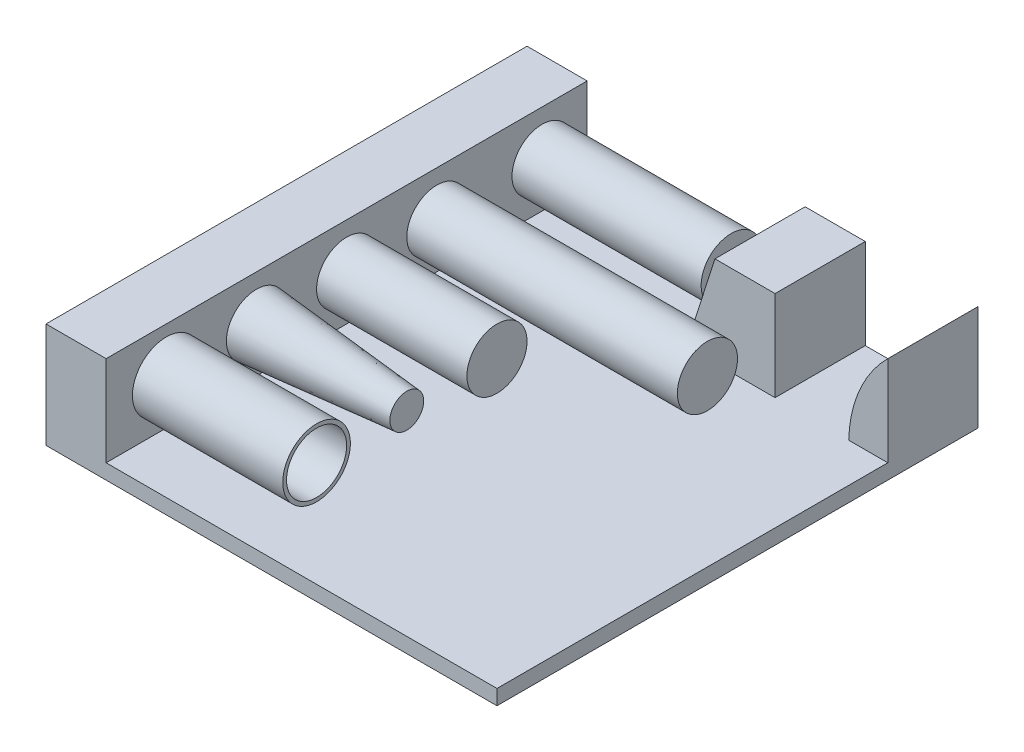
ISO-10303-21;
HEADER;
FILE_DESCRIPTION(('STEP AP214'),'2;1');
FILE_NAME('part.step','',(''),(''),'','','');
FILE_SCHEMA(('AUTOMOTIVE_DESIGN { 1 0 10303 214 1 1 1 1 }'));
ENDSEC;
DATA;
#1=APPLICATION_CONTEXT('core data for automotive mechanical design processes');
#2=APPLICATION_PROTOCOL_DEFINITION('international standard','automotive_design',2000,#1);
#3=PRODUCT_CONTEXT('',#1,'mechanical');
#4=PRODUCT('Part','Part','',(#3));
#5=PRODUCT_RELATED_PRODUCT_CATEGORY('part','',(#4));
#6=PRODUCT_DEFINITION_FORMATION('','',#4);
#7=PRODUCT_DEFINITION_CONTEXT('part definition',#1,'design');
#8=PRODUCT_DEFINITION('design','',#6,#7);
#9=PRODUCT_DEFINITION_SHAPE('','',#8);
#10=(LENGTH_UNIT() NAMED_UNIT(*) SI_UNIT(.MILLI.,.METRE.));
#11=(NAMED_UNIT(*) PLANE_ANGLE_UNIT() SI_UNIT($,.RADIAN.));
#12=(NAMED_UNIT(*) SI_UNIT($,.STERADIAN.) SOLID_ANGLE_UNIT());
#13=UNCERTAINTY_MEASURE_WITH_UNIT(LENGTH_MEASURE(1.E-05),#10,'distance_accuracy_value','');
#14=(GEOMETRIC_REPRESENTATION_CONTEXT(3) GLOBAL_UNCERTAINTY_ASSIGNED_CONTEXT((#13)) GLOBAL_UNIT_ASSIGNED_CONTEXT((#10,
#11,#12)) REPRESENTATION_CONTEXT('',''));
#15=CARTESIAN_POINT('',(0.,0.,0.));
#16=DIRECTION('',(0.,0.,1.));
#17=DIRECTION('',(1.,0.,0.));
#18=AXIS2_PLACEMENT_3D('',#15,#16,#17);
#19=CARTESIAN_POINT('',(-220.,20.,640.));
#20=DIRECTION('',(0.,-1.,0.));
#21=DIRECTION('',(0.,0.,-1.));
#22=AXIS2_PLACEMENT_3D('',#19,#20,#21);
#23=PLANE('',#22);
#24=DIRECTION('',(0.,0.,-1.));
#25=VECTOR('',#24,1.);
#26=CARTESIAN_POINT('',(31.6,20.,120.));
#27=LINE('',#26,#25);
#28=CARTESIAN_POINT('',(31.6,20.,120.));
#29=VERTEX_POINT('',#28);
#30=CARTESIAN_POINT('',(31.6,20.,0.));
#31=VERTEX_POINT('',#30);
#32=EDGE_CURVE('E174',#29,#31,#27,.T.);
#33=ORIENTED_EDGE('',*,*,#32,.T.);
#34=DIRECTION('',(-1.,0.,0.));
#35=VECTOR('',#34,1.);
#36=CARTESIAN_POINT('',(-220.,20.,0.));
#37=LINE('',#36,#35);
#38=CARTESIAN_POINT('',(-220.,20.,0.));
#39=VERTEX_POINT('',#38);
#40=EDGE_CURVE('E231',#31,#39,#37,.T.);
#41=ORIENTED_EDGE('',*,*,#40,.T.);
#42=DIRECTION('',(0.,0.,-1.));
#43=VECTOR('',#42,1.);
#44=CARTESIAN_POINT('',(-220.,20.,640.));
#45=LINE('',#44,#43);
#46=CARTESIAN_POINT('',(-220.,20.,640.));
#47=VERTEX_POINT('',#46);
#48=EDGE_CURVE('E247',#47,#39,#45,.T.);
#49=ORIENTED_EDGE('',*,*,#48,.F.);
#50=DIRECTION('',(-1.,0.,0.));
#51=VECTOR('',#50,1.);
#52=CARTESIAN_POINT('',(-220.,20.,640.));
#53=LINE('',#52,#51);
#54=CARTESIAN_POINT('',(300.,20.,640.));
#55=VERTEX_POINT('',#54);
#56=EDGE_CURVE('E212',#55,#47,#53,.T.);
#57=ORIENTED_EDGE('',*,*,#56,.F.);
#58=DIRECTION('',(0.,0.,-1.));
#59=VECTOR('',#58,1.);
#60=CARTESIAN_POINT('',(300.,20.,640.));
#61=LINE('',#60,#59);
#62=CARTESIAN_POINT('',(300.,20.,120.));
#63=VERTEX_POINT('',#62);
#64=EDGE_CURVE('E251',#55,#63,#61,.T.);
#65=ORIENTED_EDGE('',*,*,#64,.T.);
#66=DIRECTION('',(1.,0.,0.));
#67=VECTOR('',#66,1.);
#68=CARTESIAN_POINT('',(300.,20.,120.));
#69=LINE('',#68,#67);
#70=CARTESIAN_POINT('',(247.956312481218,20.,120.));
#71=VERTEX_POINT('',#70);
#72=EDGE_CURVE('E178',#71,#63,#69,.T.);
#73=ORIENTED_EDGE('',*,*,#72,.F.);
#74=DIRECTION('',(0.,0.,-1.));
#75=VECTOR('',#74,1.);
#76=CARTESIAN_POINT('',(247.956312481219,20.,120.));
#77=LINE('',#76,#75);
#78=CARTESIAN_POINT('',(247.956312481219,20.,0.));
#79=VERTEX_POINT('',#78);
#80=EDGE_CURVE('E189',#71,#79,#77,.T.);
#81=ORIENTED_EDGE('',*,*,#80,.T.);
#82=CARTESIAN_POINT('',(150.,20.,0.));
#83=VERTEX_POINT('',#82);
#84=EDGE_CURVE('E232',#79,#83,#37,.T.);
#85=ORIENTED_EDGE('',*,*,#84,.T.);
#86=DIRECTION('',(0.,0.,-1.));
#87=VECTOR('',#86,1.);
#88=CARTESIAN_POINT('',(150.,20.,120.));
#89=LINE('',#88,#87);
#90=CARTESIAN_POINT('',(150.,20.,120.));
#91=VERTEX_POINT('',#90);
#92=EDGE_CURVE('E66',#91,#83,#89,.T.);
#93=ORIENTED_EDGE('',*,*,#92,.F.);
#94=DIRECTION('',(1.,0.,0.));
#95=VECTOR('',#94,1.);
#96=CARTESIAN_POINT('',(150.,20.,120.));
#97=LINE('',#96,#95);
#98=EDGE_CURVE('E61',#29,#91,#97,.T.);
#99=ORIENTED_EDGE('',*,*,#98,.F.);
#100=EDGE_LOOP('',(#33,#41,#49,#57,#65,#73,#81,#85,#93,#99));
#101=FACE_BOUND('',#100,.T.);
#102=ADVANCED_FACE('F45',(#101),#23,.F.);
#103=CARTESIAN_POINT('',(-300.,0.,640.));
#104=DIRECTION('',(1.,0.,0.));
#105=DIRECTION('',(0.,0.,-1.));
#106=AXIS2_PLACEMENT_3D('',#103,#104,#105);
#107=PLANE('',#106);
#108=DIRECTION('',(0.,-1.,0.));
#109=VECTOR('',#108,1.);
#110=CARTESIAN_POINT('',(-300.,0.,0.));
#111=LINE('',#110,#109);
#112=CARTESIAN_POINT('',(-300.,140.,0.));
#113=VERTEX_POINT('',#112);
#114=CARTESIAN_POINT('',(-300.,0.,0.));
#115=VERTEX_POINT('',#114);
#116=EDGE_CURVE('E200',#113,#115,#111,.T.);
#117=ORIENTED_EDGE('',*,*,#116,.T.);
#118=DIRECTION('',(0.,0.,-1.));
#119=VECTOR('',#118,1.);
#120=CARTESIAN_POINT('',(-300.,0.,640.));
#121=LINE('',#120,#119);
#122=CARTESIAN_POINT('',(-300.,0.,640.));
#123=VERTEX_POINT('',#122);
#124=EDGE_CURVE('E258',#123,#115,#121,.T.);
#125=ORIENTED_EDGE('',*,*,#124,.F.);
#126=DIRECTION('',(0.,-1.,0.));
#127=VECTOR('',#126,1.);
#128=CARTESIAN_POINT('',(-300.,0.,640.));
#129=LINE('',#128,#127);
#130=CARTESIAN_POINT('',(-300.,140.,640.));
#131=VERTEX_POINT('',#130);
#132=EDGE_CURVE('E201',#131,#123,#129,.T.);
#133=ORIENTED_EDGE('',*,*,#132,.F.);
#134=DIRECTION('',(0.,0.,-1.));
#135=VECTOR('',#134,1.);
#136=CARTESIAN_POINT('',(-300.,140.,640.));
#137=LINE('',#136,#135);
#138=EDGE_CURVE('E221',#131,#113,#137,.T.);
#139=ORIENTED_EDGE('',*,*,#138,.T.);
#140=EDGE_LOOP('',(#117,#125,#133,#139));
#141=FACE_BOUND('',#140,.T.);
#142=ADVANCED_FACE('F47',(#141),#107,.F.);
#143=CARTESIAN_POINT('',(-300.,0.,640.));
#144=DIRECTION('',(0.,1.,0.));
#145=DIRECTION('',(0.,0.,1.));
#146=AXIS2_PLACEMENT_3D('',#143,#144,#145);
#147=PLANE('',#146);
#148=DIRECTION('',(1.,0.,0.));
#149=VECTOR('',#148,1.);
#150=CARTESIAN_POINT('',(-300.,0.,0.));
#151=LINE('',#150,#149);
#152=CARTESIAN_POINT('',(300.,0.,0.));
#153=VERTEX_POINT('',#152);
#154=EDGE_CURVE('E225',#115,#153,#151,.T.);
#155=ORIENTED_EDGE('',*,*,#154,.T.);
#156=DIRECTION('',(0.,0.,-1.));
#157=VECTOR('',#156,1.);
#158=CARTESIAN_POINT('',(300.,0.,640.));
#159=LINE('',#158,#157);
#160=CARTESIAN_POINT('',(300.,0.,640.));
#161=VERTEX_POINT('',#160);
#162=EDGE_CURVE('E254',#161,#153,#159,.T.);
#163=ORIENTED_EDGE('',*,*,#162,.F.);
#164=DIRECTION('',(1.,0.,0.));
#165=VECTOR('',#164,1.);
#166=CARTESIAN_POINT('',(-300.,0.,640.));
#167=LINE('',#166,#165);
#168=EDGE_CURVE('E205',#123,#161,#167,.T.);
#169=ORIENTED_EDGE('',*,*,#168,.F.);
#170=ORIENTED_EDGE('',*,*,#124,.T.);
#171=EDGE_LOOP('',(#155,#163,#169,#170));
#172=FACE_BOUND('',#171,.T.);
#173=ADVANCED_FACE('F374',(#172),#147,.F.);
#174=CARTESIAN_POINT('',(300.,20.,640.));
#175=DIRECTION('',(-1.,0.,0.));
#176=DIRECTION('',(0.,0.,1.));
#177=AXIS2_PLACEMENT_3D('',#174,#175,#176);
#178=PLANE('',#177);
#179=DIRECTION('',(0.,1.,0.));
#180=VECTOR('',#179,1.);
#181=CARTESIAN_POINT('',(300.,20.,0.));
#182=LINE('',#181,#180);
#183=CARTESIAN_POINT('',(300.,140.,0.));
#184=VERTEX_POINT('',#183);
#185=EDGE_CURVE('E228',#153,#184,#182,.T.);
#186=ORIENTED_EDGE('',*,*,#185,.T.);
#187=DIRECTION('',(0.,0.,-1.));
#188=VECTOR('',#187,1.);
#189=CARTESIAN_POINT('',(300.,140.,120.));
#190=LINE('',#189,#188);
#191=CARTESIAN_POINT('',(300.,140.,120.));
#192=VERTEX_POINT('',#191);
#193=EDGE_CURVE('E196',#192,#184,#190,.T.);
#194=ORIENTED_EDGE('',*,*,#193,.F.);
#195=DIRECTION('',(0.,1.,0.));
#196=VECTOR('',#195,1.);
#197=CARTESIAN_POINT('',(300.,140.,120.));
#198=LINE('',#197,#196);
#199=EDGE_CURVE('E182',#63,#192,#198,.T.);
#200=ORIENTED_EDGE('',*,*,#199,.F.);
#201=ORIENTED_EDGE('',*,*,#64,.F.);
#202=DIRECTION('',(0.,1.,0.));
#203=VECTOR('',#202,1.);
#204=CARTESIAN_POINT('',(300.,20.,640.));
#205=LINE('',#204,#203);
#206=EDGE_CURVE('E209',#161,#55,#205,.T.);
#207=ORIENTED_EDGE('',*,*,#206,.F.);
#208=ORIENTED_EDGE('',*,*,#162,.T.);
#209=EDGE_LOOP('',(#186,#194,#200,#201,#207,#208));
#210=FACE_BOUND('',#209,.T.);
#211=ADVANCED_FACE('F279',(#210),#178,.F.);
#212=CARTESIAN_POINT('',(-220.,140.,640.));
#213=DIRECTION('',(-1.,0.,0.));
#214=DIRECTION('',(0.,0.,1.));
#215=AXIS2_PLACEMENT_3D('',#212,#213,#214);
#216=PLANE('',#215);
#217=CARTESIAN_POINT('',(-220.,80.,560.));
#218=DIRECTION('',(-1.,0.,0.));
#219=DIRECTION('',(0.,0.,1.));
#220=AXIS2_PLACEMENT_3D('',#217,#218,#219);
#221=CIRCLE('',#220,45.);
#222=CARTESIAN_POINT('',(-220.,80.,605.));
#223=VERTEX_POINT('',#222);
#224=EDGE_CURVE('E12',#223,#223,#221,.F.);
#225=ORIENTED_EDGE('',*,*,#224,.F.);
#226=EDGE_LOOP('',(#225));
#227=FACE_BOUND('',#226,.T.);
#228=CARTESIAN_POINT('',(-220.,80.,440.));
#229=DIRECTION('',(-1.,0.,0.));
#230=DIRECTION('',(0.,0.,1.));
#231=AXIS2_PLACEMENT_3D('',#228,#229,#230);
#232=CIRCLE('',#231,40.);
#233=CARTESIAN_POINT('',(-220.,80.,480.));
#234=VERTEX_POINT('',#233);
#235=EDGE_CURVE('E54',#234,#234,#232,.F.);
#236=ORIENTED_EDGE('',*,*,#235,.F.);
#237=EDGE_LOOP('',(#236));
#238=FACE_BOUND('',#237,.T.);
#239=CARTESIAN_POINT('',(-220.,80.,320.));
#240=DIRECTION('',(-1.,0.,0.));
#241=DIRECTION('',(0.,0.,1.));
#242=AXIS2_PLACEMENT_3D('',#239,#240,#241);
#243=CIRCLE('',#242,40.);
#244=CARTESIAN_POINT('',(-220.,80.,360.));
#245=VERTEX_POINT('',#244);
#246=EDGE_CURVE('E266',#245,#245,#243,.F.);
#247=ORIENTED_EDGE('',*,*,#246,.F.);
#248=EDGE_LOOP('',(#247));
#249=FACE_BOUND('',#248,.T.);
#250=CARTESIAN_POINT('',(-220.,80.,200.));
#251=DIRECTION('',(-1.,0.,0.));
#252=DIRECTION('',(0.,0.,1.));
#253=AXIS2_PLACEMENT_3D('',#250,#251,#252);
#254=CIRCLE('',#253,40.);
#255=CARTESIAN_POINT('',(-220.,80.,240.));
#256=VERTEX_POINT('',#255);
#257=EDGE_CURVE('E288',#256,#256,#254,.F.);
#258=ORIENTED_EDGE('',*,*,#257,.F.);
#259=EDGE_LOOP('',(#258));
#260=FACE_BOUND('',#259,.T.);
#261=CARTESIAN_POINT('',(-220.,80.,60.));
#262=DIRECTION('',(-1.,0.,0.));
#263=DIRECTION('',(0.,0.,1.));
#264=AXIS2_PLACEMENT_3D('',#261,#262,#263);
#265=CIRCLE('',#264,40.);
#266=CARTESIAN_POINT('',(-220.,80.,100.));
#267=VERTEX_POINT('',#266);
#268=EDGE_CURVE('E262',#267,#267,#265,.F.);
#269=ORIENTED_EDGE('',*,*,#268,.F.);
#270=EDGE_LOOP('',(#269));
#271=FACE_BOUND('',#270,.T.);
#272=DIRECTION('',(0.,1.,0.));
#273=VECTOR('',#272,1.);
#274=CARTESIAN_POINT('',(-220.,140.,0.));
#275=LINE('',#274,#273);
#276=CARTESIAN_POINT('',(-220.,140.,0.));
#277=VERTEX_POINT('',#276);
#278=EDGE_CURVE('E235',#39,#277,#275,.T.);
#279=ORIENTED_EDGE('',*,*,#278,.T.);
#280=DIRECTION('',(0.,0.,-1.));
#281=VECTOR('',#280,1.);
#282=CARTESIAN_POINT('',(-220.,140.,640.));
#283=LINE('',#282,#281);
#284=CARTESIAN_POINT('',(-220.,140.,640.));
#285=VERTEX_POINT('',#284);
#286=EDGE_CURVE('E243',#285,#277,#283,.T.);
#287=ORIENTED_EDGE('',*,*,#286,.F.);
#288=DIRECTION('',(0.,1.,0.));
#289=VECTOR('',#288,1.);
#290=CARTESIAN_POINT('',(-220.,140.,640.));
#291=LINE('',#290,#289);
#292=EDGE_CURVE('E215',#47,#285,#291,.T.);
#293=ORIENTED_EDGE('',*,*,#292,.F.);
#294=ORIENTED_EDGE('',*,*,#48,.T.);
#295=EDGE_LOOP('',(#279,#287,#293,#294));
#296=FACE_BOUND('',#295,.T.);
#297=ADVANCED_FACE('F275',(#227,#238,#249,#260,#271,#296),#216,.F.);
#298=CARTESIAN_POINT('',(-300.,140.,640.));
#299=DIRECTION('',(0.,-1.,0.));
#300=DIRECTION('',(0.,0.,-1.));
#301=AXIS2_PLACEMENT_3D('',#298,#299,#300);
#302=PLANE('',#301);
#303=DIRECTION('',(-1.,0.,0.));
#304=VECTOR('',#303,1.);
#305=CARTESIAN_POINT('',(-300.,140.,0.));
#306=LINE('',#305,#304);
#307=EDGE_CURVE('E206',#277,#113,#306,.T.);
#308=ORIENTED_EDGE('',*,*,#307,.T.);
#309=ORIENTED_EDGE('',*,*,#138,.F.);
#310=DIRECTION('',(-1.,0.,0.));
#311=VECTOR('',#310,1.);
#312=CARTESIAN_POINT('',(-300.,140.,640.));
#313=LINE('',#312,#311);
#314=EDGE_CURVE('E218',#285,#131,#313,.T.);
#315=ORIENTED_EDGE('',*,*,#314,.F.);
#316=ORIENTED_EDGE('',*,*,#286,.T.);
#317=EDGE_LOOP('',(#308,#309,#315,#316));
#318=FACE_BOUND('',#317,.T.);
#319=ADVANCED_FACE('F278',(#318),#302,.F.);
#320=CARTESIAN_POINT('',(0.,0.,640.));
#321=DIRECTION('',(0.,0.,-1.));
#322=DIRECTION('',(-1.,0.,0.));
#323=AXIS2_PLACEMENT_3D('',#320,#321,#322);
#324=PLANE('',#323);
#325=ORIENTED_EDGE('',*,*,#132,.T.);
#326=ORIENTED_EDGE('',*,*,#168,.T.);
#327=ORIENTED_EDGE('',*,*,#206,.T.);
#328=ORIENTED_EDGE('',*,*,#56,.T.);
#329=ORIENTED_EDGE('',*,*,#292,.T.);
#330=ORIENTED_EDGE('',*,*,#314,.T.);
#331=EDGE_LOOP('',(#325,#326,#327,#328,#329,#330));
#332=FACE_BOUND('',#331,.T.);
#333=ADVANCED_FACE('F307',(#332),#324,.F.);
#334=CARTESIAN_POINT('',(0.,0.,0.));
#335=DIRECTION('',(0.,0.,-1.));
#336=DIRECTION('',(-1.,0.,0.));
#337=AXIS2_PLACEMENT_3D('',#334,#335,#336);
#338=PLANE('',#337);
#339=ORIENTED_EDGE('',*,*,#116,.F.);
#340=ORIENTED_EDGE('',*,*,#307,.F.);
#341=ORIENTED_EDGE('',*,*,#278,.F.);
#342=ORIENTED_EDGE('',*,*,#40,.F.);
#343=DIRECTION('',(-0.304775727103784,-0.952424147199324,0.));
#344=VECTOR('',#343,1.);
#345=CARTESIAN_POINT('',(31.6,20.,0.));
#346=LINE('',#345,#344);
#347=CARTESIAN_POINT('',(70.,140.,0.));
#348=VERTEX_POINT('',#347);
#349=EDGE_CURVE('E161',#348,#31,#346,.T.);
#350=ORIENTED_EDGE('',*,*,#349,.F.);
#351=DIRECTION('',(-1.,0.,0.));
#352=VECTOR('',#351,1.);
#353=CARTESIAN_POINT('',(150.,140.,0.));
#354=LINE('',#353,#352);
#355=CARTESIAN_POINT('',(150.,140.,0.));
#356=VERTEX_POINT('',#355);
#357=EDGE_CURVE('E168',#356,#348,#354,.T.);
#358=ORIENTED_EDGE('',*,*,#357,.F.);
#359=DIRECTION('',(0.,1.,0.));
#360=VECTOR('',#359,1.);
#361=CARTESIAN_POINT('',(150.,140.,0.));
#362=LINE('',#361,#360);
#363=EDGE_CURVE('E146',#83,#356,#362,.T.);
#364=ORIENTED_EDGE('',*,*,#363,.F.);
#365=ORIENTED_EDGE('',*,*,#84,.F.);
#366=CARTESIAN_POINT('',(423.85224033938,15.,0.));
#367=DIRECTION('',(0.,0.,1.));
#368=DIRECTION('',(1.,0.,0.));
#369=AXIS2_PLACEMENT_3D('',#366,#367,#368);
#370=CIRCLE('',#369,175.966978257523);
#371=EDGE_CURVE('E177',#184,#79,#370,.T.);
#372=ORIENTED_EDGE('',*,*,#371,.F.);
#373=ORIENTED_EDGE('',*,*,#185,.F.);
#374=ORIENTED_EDGE('',*,*,#154,.F.);
#375=EDGE_LOOP('',(#339,#340,#341,#342,#350,#358,#364,#365,#372,#373,#374));
#376=FACE_BOUND('',#375,.T.);
#377=ADVANCED_FACE('F301',(#376),#338,.T.);
#378=CARTESIAN_POINT('',(423.85224033938,15.,120.));
#379=DIRECTION('',(0.,0.,-1.));
#380=DIRECTION('',(-1.,0.,0.));
#381=AXIS2_PLACEMENT_3D('',#378,#379,#380);
#382=CYLINDRICAL_SURFACE('',#381,175.966978257523);
#383=ORIENTED_EDGE('',*,*,#371,.T.);
#384=ORIENTED_EDGE('',*,*,#80,.F.);
#385=CARTESIAN_POINT('',(423.85224033938,15.,120.));
#386=DIRECTION('',(0.,0.,1.));
#387=DIRECTION('',(1.,0.,0.));
#388=AXIS2_PLACEMENT_3D('',#385,#386,#387);
#389=CIRCLE('',#388,175.966978257523);
#390=EDGE_CURVE('E185',#192,#71,#389,.T.);
#391=ORIENTED_EDGE('',*,*,#390,.F.);
#392=ORIENTED_EDGE('',*,*,#193,.T.);
#393=EDGE_LOOP('',(#383,#384,#391,#392));
#394=FACE_BOUND('',#393,.T.);
#395=ADVANCED_FACE('F387',(#394),#382,.T.);
#396=CARTESIAN_POINT('',(423.85224033938,15.,120.));
#397=DIRECTION('',(0.,0.,1.));
#398=DIRECTION('',(1.,0.,0.));
#399=AXIS2_PLACEMENT_3D('',#396,#397,#398);
#400=PLANE('',#399);
#401=ORIENTED_EDGE('',*,*,#72,.T.);
#402=ORIENTED_EDGE('',*,*,#199,.T.);
#403=ORIENTED_EDGE('',*,*,#390,.T.);
#404=EDGE_LOOP('',(#401,#402,#403));
#405=FACE_BOUND('',#404,.T.);
#406=ADVANCED_FACE('F391',(#405),#400,.T.);
#407=CARTESIAN_POINT('',(31.6,20.,120.));
#408=DIRECTION('',(0.952424147199324,-0.304775727103784,0.));
#409=DIRECTION('',(0.304775727103784,0.952424147199324,0.));
#410=AXIS2_PLACEMENT_3D('',#407,#408,#409);
#411=PLANE('',#410);
#412=ORIENTED_EDGE('',*,*,#349,.T.);
#413=ORIENTED_EDGE('',*,*,#32,.F.);
#414=DIRECTION('',(-0.304775727103784,-0.952424147199324,0.));
#415=VECTOR('',#414,1.);
#416=CARTESIAN_POINT('',(31.6,20.,120.));
#417=LINE('',#416,#415);
#418=CARTESIAN_POINT('',(70.,140.,120.));
#419=VERTEX_POINT('',#418);
#420=EDGE_CURVE('E170',#419,#29,#417,.T.);
#421=ORIENTED_EDGE('',*,*,#420,.F.);
#422=DIRECTION('',(0.,0.,-1.));
#423=VECTOR('',#422,1.);
#424=CARTESIAN_POINT('',(70.,140.,120.));
#425=LINE('',#424,#423);
#426=EDGE_CURVE('E150',#419,#348,#425,.T.);
#427=ORIENTED_EDGE('',*,*,#426,.T.);
#428=EDGE_LOOP('',(#412,#413,#421,#427));
#429=FACE_BOUND('',#428,.T.);
#430=ADVANCED_FACE('F316',(#429),#411,.F.);
#431=CARTESIAN_POINT('',(150.,140.,120.));
#432=DIRECTION('',(-1.,0.,0.));
#433=DIRECTION('',(0.,-1.,0.));
#434=AXIS2_PLACEMENT_3D('',#431,#432,#433);
#435=PLANE('',#434);
#436=ORIENTED_EDGE('',*,*,#363,.T.);
#437=DIRECTION('',(0.,0.,-1.));
#438=VECTOR('',#437,1.);
#439=CARTESIAN_POINT('',(150.,140.,120.));
#440=LINE('',#439,#438);
#441=CARTESIAN_POINT('',(150.,140.,120.));
#442=VERTEX_POINT('',#441);
#443=EDGE_CURVE('E143',#442,#356,#440,.T.);
#444=ORIENTED_EDGE('',*,*,#443,.F.);
#445=DIRECTION('',(0.,1.,0.));
#446=VECTOR('',#445,1.);
#447=CARTESIAN_POINT('',(150.,140.,120.));
#448=LINE('',#447,#446);
#449=EDGE_CURVE('E133',#91,#442,#448,.T.);
#450=ORIENTED_EDGE('',*,*,#449,.F.);
#451=ORIENTED_EDGE('',*,*,#92,.T.);
#452=EDGE_LOOP('',(#436,#444,#450,#451));
#453=FACE_BOUND('',#452,.T.);
#454=ADVANCED_FACE('F144',(#453),#435,.F.);
#455=CARTESIAN_POINT('',(150.,140.,120.));
#456=DIRECTION('',(0.,-1.,0.));
#457=DIRECTION('',(1.,0.,0.));
#458=AXIS2_PLACEMENT_3D('',#455,#456,#457);
#459=PLANE('',#458);
#460=ORIENTED_EDGE('',*,*,#357,.T.);
#461=ORIENTED_EDGE('',*,*,#426,.F.);
#462=DIRECTION('',(-1.,0.,0.));
#463=VECTOR('',#462,1.);
#464=CARTESIAN_POINT('',(150.,140.,120.));
#465=LINE('',#464,#463);
#466=EDGE_CURVE('E137',#442,#419,#465,.T.);
#467=ORIENTED_EDGE('',*,*,#466,.F.);
#468=ORIENTED_EDGE('',*,*,#443,.T.);
#469=EDGE_LOOP('',(#460,#461,#467,#468));
#470=FACE_BOUND('',#469,.T.);
#471=ADVANCED_FACE('F152',(#470),#459,.F.);
#472=CARTESIAN_POINT('',(0.,0.,120.));
#473=DIRECTION('',(0.,0.,1.));
#474=DIRECTION('',(1.,0.,0.));
#475=AXIS2_PLACEMENT_3D('',#472,#473,#474);
#476=PLANE('',#475);
#477=ORIENTED_EDGE('',*,*,#420,.T.);
#478=ORIENTED_EDGE('',*,*,#98,.T.);
#479=ORIENTED_EDGE('',*,*,#449,.T.);
#480=ORIENTED_EDGE('',*,*,#466,.T.);
#481=EDGE_LOOP('',(#477,#478,#479,#480));
#482=FACE_BOUND('',#481,.T.);
#483=ADVANCED_FACE('F135',(#482),#476,.T.);
#484=CARTESIAN_POINT('',(31.6,80.,60.));
#485=DIRECTION('',(-1.,0.,0.));
#486=DIRECTION('',(0.,0.,1.));
#487=AXIS2_PLACEMENT_3D('',#484,#485,#486);
#488=CYLINDRICAL_SURFACE('',#487,40.);
#489=CARTESIAN_POINT('',(31.6,80.,60.));
#490=DIRECTION('',(1.,0.,0.));
#491=DIRECTION('',(0.,0.,-1.));
#492=AXIS2_PLACEMENT_3D('',#489,#490,#491);
#493=CIRCLE('',#492,40.);
#494=CARTESIAN_POINT('',(31.6,80.,20.));
#495=VERTEX_POINT('',#494);
#496=EDGE_CURVE('E165',#495,#495,#493,.T.);
#497=ORIENTED_EDGE('',*,*,#496,.F.);
#498=EDGE_LOOP('',(#497));
#499=FACE_BOUND('',#498,.T.);
#500=ORIENTED_EDGE('',*,*,#268,.T.);
#501=EDGE_LOOP('',(#500));
#502=FACE_BOUND('',#501,.T.);
#503=ADVANCED_FACE('F457',(#499,#502),#488,.T.);
#504=CARTESIAN_POINT('',(31.6,80.,60.));
#505=DIRECTION('',(1.,0.,0.));
#506=DIRECTION('',(0.,0.,-1.));
#507=AXIS2_PLACEMENT_3D('',#504,#505,#506);
#508=PLANE('',#507);
#509=ORIENTED_EDGE('',*,*,#496,.T.);
#510=EDGE_LOOP('',(#509));
#511=FACE_BOUND('',#510,.T.);
#512=ADVANCED_FACE('F466',(#511),#508,.T.);
#513=CARTESIAN_POINT('',(-300.002,80.,200.));
#514=DIRECTION('',(1.,0.,0.));
#515=DIRECTION('',(0.,0.,-1.));
#516=AXIS2_PLACEMENT_3D('',#513,#514,#515);
#517=CYLINDRICAL_SURFACE('',#516,40.);
#518=ORIENTED_EDGE('',*,*,#257,.T.);
#519=EDGE_LOOP('',(#518));
#520=FACE_BOUND('',#519,.T.);
#521=CARTESIAN_POINT('',(140.,80.,200.));
#522=DIRECTION('',(1.,0.,0.));
#523=DIRECTION('',(0.,0.,-1.));
#524=AXIS2_PLACEMENT_3D('',#521,#522,#523);
#525=CIRCLE('',#524,40.);
#526=CARTESIAN_POINT('',(140.,80.,160.));
#527=VERTEX_POINT('',#526);
#528=EDGE_CURVE('E326',#527,#527,#525,.T.);
#529=ORIENTED_EDGE('',*,*,#528,.F.);
#530=EDGE_LOOP('',(#529));
#531=FACE_BOUND('',#530,.T.);
#532=ADVANCED_FACE('F476',(#520,#531),#517,.T.);
#533=CARTESIAN_POINT('',(140.,80.,200.));
#534=DIRECTION('',(1.,0.,0.));
#535=DIRECTION('',(0.,0.,-1.));
#536=AXIS2_PLACEMENT_3D('',#533,#534,#535);
#537=PLANE('',#536);
#538=ORIENTED_EDGE('',*,*,#528,.T.);
#539=EDGE_LOOP('',(#538));
#540=FACE_BOUND('',#539,.T.);
#541=ADVANCED_FACE('F486',(#540),#537,.T.);
#542=CARTESIAN_POINT('',(-20.,80.,320.));
#543=DIRECTION('',(-1.,0.,0.));
#544=DIRECTION('',(0.,0.,1.));
#545=AXIS2_PLACEMENT_3D('',#542,#543,#544);
#546=CYLINDRICAL_SURFACE('',#545,40.);
#547=CARTESIAN_POINT('',(-20.,80.,320.));
#548=DIRECTION('',(1.,0.,0.));
#549=DIRECTION('',(0.,0.,-1.));
#550=AXIS2_PLACEMENT_3D('',#547,#548,#549);
#551=CIRCLE('',#550,40.);
#552=CARTESIAN_POINT('',(-20.,80.,280.));
#553=VERTEX_POINT('',#552);
#554=EDGE_CURVE('E330',#553,#553,#551,.T.);
#555=ORIENTED_EDGE('',*,*,#554,.F.);
#556=EDGE_LOOP('',(#555));
#557=FACE_BOUND('',#556,.T.);
#558=ORIENTED_EDGE('',*,*,#246,.T.);
#559=EDGE_LOOP('',(#558));
#560=FACE_BOUND('',#559,.T.);
#561=ADVANCED_FACE('F496',(#557,#560),#546,.T.);
#562=CARTESIAN_POINT('',(-20.,80.,320.));
#563=DIRECTION('',(1.,0.,0.));
#564=DIRECTION('',(0.,0.,-1.));
#565=AXIS2_PLACEMENT_3D('',#562,#563,#564);
#566=PLANE('',#565);
#567=ORIENTED_EDGE('',*,*,#554,.T.);
#568=EDGE_LOOP('',(#567));
#569=FACE_BOUND('',#568,.T.);
#570=ADVANCED_FACE('F506',(#569),#566,.T.);
#571=CARTESIAN_POINT('',(-220.,80.,440.));
#572=DIRECTION('',(-1.,0.,0.));
#573=DIRECTION('',(0.,0.,-1.));
#574=AXIS2_PLACEMENT_3D('',#571,#572,#573);
#575=CONICAL_SURFACE('',#574,40.,0.0872664625997167);
#576=CARTESIAN_POINT('',(-20.,80.,440.));
#577=DIRECTION('',(1.,0.,0.));
#578=DIRECTION('',(0.,0.,-1.));
#579=AXIS2_PLACEMENT_3D('',#576,#577,#578);
#580=CIRCLE('',#579,22.5022672948151);
#581=CARTESIAN_POINT('',(-20.,80.,417.497732705185));
#582=VERTEX_POINT('',#581);
#583=EDGE_CURVE('E334',#582,#582,#580,.T.);
#584=ORIENTED_EDGE('',*,*,#583,.F.);
#585=EDGE_LOOP('',(#584));
#586=FACE_BOUND('',#585,.T.);
#587=ORIENTED_EDGE('',*,*,#235,.T.);
#588=EDGE_LOOP('',(#587));
#589=FACE_BOUND('',#588,.T.);
#590=ADVANCED_FACE('F273',(#586,#589),#575,.T.);
#591=CARTESIAN_POINT('',(-20.,80.,440.));
#592=DIRECTION('',(1.,0.,0.));
#593=DIRECTION('',(0.,0.,-1.));
#594=AXIS2_PLACEMENT_3D('',#591,#592,#593);
#595=PLANE('',#594);
#596=ORIENTED_EDGE('',*,*,#583,.T.);
#597=EDGE_LOOP('',(#596));
#598=FACE_BOUND('',#597,.T.);
#599=ADVANCED_FACE('F357',(#598),#595,.T.);
#600=CARTESIAN_POINT('',(-20.,80.,560.));
#601=DIRECTION('',(1.,0.,0.));
#602=DIRECTION('',(0.,0.,-1.));
#603=AXIS2_PLACEMENT_3D('',#600,#601,#602);
#604=PLANE('',#603);
#605=CARTESIAN_POINT('',(-20.,80.,560.));
#606=DIRECTION('',(1.,0.,0.));
#607=DIRECTION('',(0.,0.,-1.));
#608=AXIS2_PLACEMENT_3D('',#605,#606,#607);
#609=CIRCLE('',#608,45.);
#610=CARTESIAN_POINT('',(-20.,80.,515.));
#611=VERTEX_POINT('',#610);
#612=EDGE_CURVE('E338',#611,#611,#609,.T.);
#613=ORIENTED_EDGE('',*,*,#612,.T.);
#614=EDGE_LOOP('',(#613));
#615=FACE_BOUND('',#614,.T.);
#616=CARTESIAN_POINT('',(-20.,80.,560.));
#617=DIRECTION('',(1.,0.,0.));
#618=DIRECTION('',(0.,0.,-1.));
#619=AXIS2_PLACEMENT_3D('',#616,#617,#618);
#620=CIRCLE('',#619,40.);
#621=CARTESIAN_POINT('',(-20.,80.,520.));
#622=VERTEX_POINT('',#621);
#623=EDGE_CURVE('E342',#622,#622,#620,.T.);
#624=ORIENTED_EDGE('',*,*,#623,.F.);
#625=EDGE_LOOP('',(#624));
#626=FACE_BOUND('',#625,.T.);
#627=ADVANCED_FACE('F354',(#615,#626),#604,.T.);
#628=CARTESIAN_POINT('',(-20.,80.,560.));
#629=DIRECTION('',(-1.,0.,0.));
#630=DIRECTION('',(0.,0.,1.));
#631=AXIS2_PLACEMENT_3D('',#628,#629,#630);
#632=CYLINDRICAL_SURFACE('',#631,45.);
#633=ORIENTED_EDGE('',*,*,#612,.F.);
#634=EDGE_LOOP('',(#633));
#635=FACE_BOUND('',#634,.T.);
#636=ORIENTED_EDGE('',*,*,#224,.T.);
#637=EDGE_LOOP('',(#636));
#638=FACE_BOUND('',#637,.T.);
#639=ADVANCED_FACE('F356',(#635,#638),#632,.T.);
#640=CARTESIAN_POINT('',(-20.,80.,560.));
#641=DIRECTION('',(-1.,0.,0.));
#642=DIRECTION('',(0.,0.,1.));
#643=AXIS2_PLACEMENT_3D('',#640,#641,#642);
#644=CYLINDRICAL_SURFACE('',#643,40.);
#645=ORIENTED_EDGE('',*,*,#623,.T.);
#646=EDGE_LOOP('',(#645));
#647=FACE_BOUND('',#646,.T.);
#648=CARTESIAN_POINT('',(-220.,80.,560.));
#649=DIRECTION('',(1.,0.,0.));
#650=DIRECTION('',(0.,0.,-1.));
#651=AXIS2_PLACEMENT_3D('',#648,#649,#650);
#652=CIRCLE('',#651,40.);
#653=CARTESIAN_POINT('',(-220.,80.,520.));
#654=VERTEX_POINT('',#653);
#655=EDGE_CURVE('E343',#654,#654,#652,.T.);
#656=ORIENTED_EDGE('',*,*,#655,.F.);
#657=EDGE_LOOP('',(#656));
#658=FACE_BOUND('',#657,.T.);
#659=ADVANCED_FACE('F351',(#647,#658),#644,.F.);
#660=ORIENTED_EDGE('',*,*,#655,.T.);
#661=EDGE_LOOP('',(#660));
#662=FACE_BOUND('',#661,.T.);
#663=ADVANCED_FACE('F282',(#662),#216,.F.);
#664=CLOSED_SHELL('',(#102,#142,#173,#211,#297,#319,#333,#377,#395,#406,#430,#454,#471,#483,
#503,#512,#532,#541,#561,#570,#590,#599,#627,#639,#659,#663));
#665=MANIFOLD_SOLID_BREP('B2',#664);
#666=ADVANCED_BREP_SHAPE_REPRESENTATION('',(#18,#665),#14);
#667=SHAPE_DEFINITION_REPRESENTATION(#9,#666);
ENDSEC;
END-ISO-10303-21;
